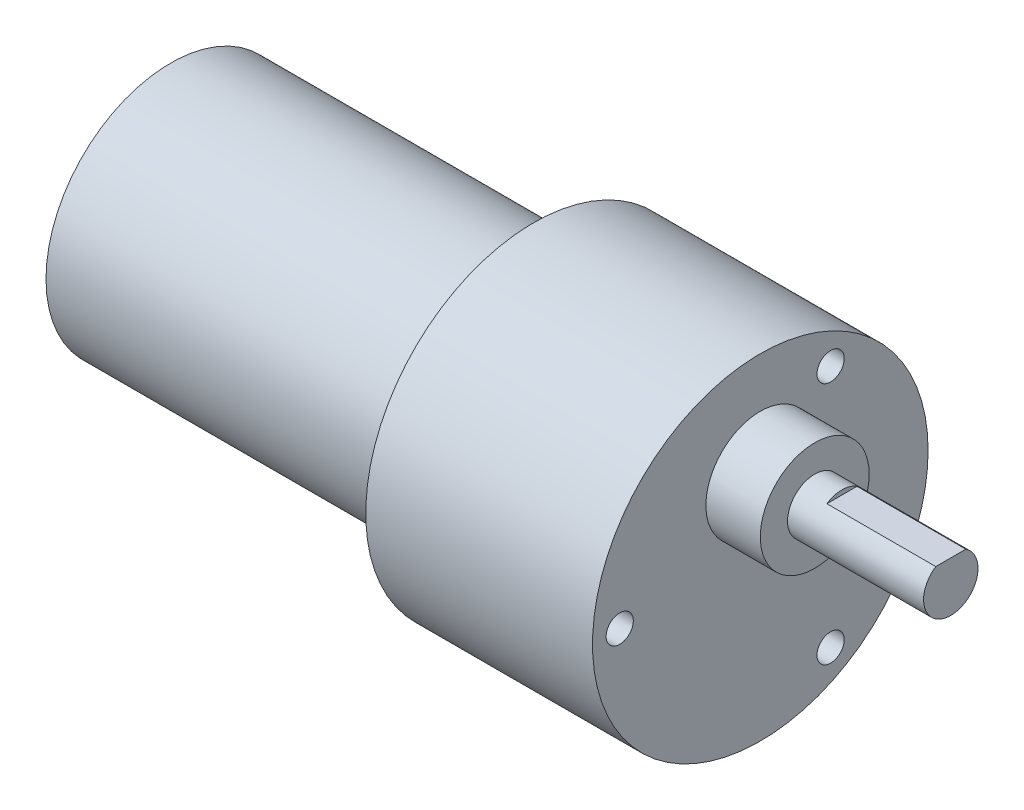
ISO-10303-21;
HEADER;
FILE_DESCRIPTION(('STEP AP214'),'2;1');
FILE_NAME('part.step','',(''),(''),'','','');
FILE_SCHEMA(('AUTOMOTIVE_DESIGN { 1 0 10303 214 1 1 1 1 }'));
ENDSEC;
DATA;
#1=APPLICATION_CONTEXT('core data for automotive mechanical design processes');
#2=APPLICATION_PROTOCOL_DEFINITION('international standard','automotive_design',2000,#1);
#3=PRODUCT_CONTEXT('',#1,'mechanical');
#4=PRODUCT('Part','Part','',(#3));
#5=PRODUCT_RELATED_PRODUCT_CATEGORY('part','',(#4));
#6=PRODUCT_DEFINITION_FORMATION('','',#4);
#7=PRODUCT_DEFINITION_CONTEXT('part definition',#1,'design');
#8=PRODUCT_DEFINITION('design','',#6,#7);
#9=PRODUCT_DEFINITION_SHAPE('','',#8);
#10=(LENGTH_UNIT() NAMED_UNIT(*) SI_UNIT(.MILLI.,.METRE.));
#11=(NAMED_UNIT(*) PLANE_ANGLE_UNIT() SI_UNIT($,.RADIAN.));
#12=(NAMED_UNIT(*) SI_UNIT($,.STERADIAN.) SOLID_ANGLE_UNIT());
#13=UNCERTAINTY_MEASURE_WITH_UNIT(LENGTH_MEASURE(1.E-05),#10,'distance_accuracy_value','');
#14=(GEOMETRIC_REPRESENTATION_CONTEXT(3) GLOBAL_UNCERTAINTY_ASSIGNED_CONTEXT((#13)) GLOBAL_UNIT_ASSIGNED_CONTEXT((#10,
#11,#12)) REPRESENTATION_CONTEXT('',''));
#15=CARTESIAN_POINT('',(0.,0.,0.));
#16=DIRECTION('',(0.,0.,1.));
#17=DIRECTION('',(1.,0.,0.));
#18=AXIS2_PLACEMENT_3D('',#15,#16,#17);
#19=CARTESIAN_POINT('',(20.,0.,0.));
#20=DIRECTION('',(-1.,0.,0.));
#21=DIRECTION('',(0.,0.,1.));
#22=AXIS2_PLACEMENT_3D('',#19,#20,#21);
#23=CYLINDRICAL_SURFACE('',#22,13.75);
#24=CARTESIAN_POINT('',(18.,0.,0.));
#25=DIRECTION('',(1.,0.,0.));
#26=DIRECTION('',(0.,0.,-1.));
#27=AXIS2_PLACEMENT_3D('',#24,#25,#26);
#28=CIRCLE('',#27,13.75);
#29=CARTESIAN_POINT('',(18.,0.,-13.75));
#30=VERTEX_POINT('',#29);
#31=EDGE_CURVE('E11',#30,#30,#28,.F.);
#32=ORIENTED_EDGE('',*,*,#31,.T.);
#33=EDGE_LOOP('',(#32));
#34=FACE_BOUND('',#33,.T.);
#35=CARTESIAN_POINT('',(-20.,0.,0.));
#36=DIRECTION('',(1.,0.,0.));
#37=DIRECTION('',(0.,0.,-1.));
#38=AXIS2_PLACEMENT_3D('',#35,#36,#37);
#39=CIRCLE('',#38,13.75);
#40=CARTESIAN_POINT('',(-20.,0.,-13.75));
#41=VERTEX_POINT('',#40);
#42=EDGE_CURVE('E102',#41,#41,#39,.T.);
#43=ORIENTED_EDGE('',*,*,#42,.T.);
#44=EDGE_LOOP('',(#43));
#45=FACE_BOUND('',#44,.T.);
#46=ADVANCED_FACE('F38',(#34,#45),#23,.T.);
#47=CARTESIAN_POINT('',(-20.,0.,0.));
#48=DIRECTION('',(1.,0.,0.));
#49=DIRECTION('',(0.,0.,-1.));
#50=AXIS2_PLACEMENT_3D('',#47,#48,#49);
#51=PLANE('',#50);
#52=CARTESIAN_POINT('',(-20.,0.,0.));
#53=DIRECTION('',(-1.,0.,0.));
#54=DIRECTION('',(0.,0.,1.));
#55=AXIS2_PLACEMENT_3D('',#52,#53,#54);
#56=CIRCLE('',#55,5.1);
#57=CARTESIAN_POINT('',(-20.,0.,5.1));
#58=VERTEX_POINT('',#57);
#59=EDGE_CURVE('E90',#58,#58,#56,.T.);
#60=ORIENTED_EDGE('',*,*,#59,.F.);
#61=EDGE_LOOP('',(#60));
#62=FACE_BOUND('',#61,.T.);
#63=ORIENTED_EDGE('',*,*,#42,.F.);
#64=EDGE_LOOP('',(#63));
#65=FACE_BOUND('',#64,.T.);
#66=ADVANCED_FACE('F123',(#62,#65),#51,.F.);
#67=CARTESIAN_POINT('',(-23.,0.,0.));
#68=DIRECTION('',(1.,0.,0.));
#69=DIRECTION('',(0.,0.,-1.));
#70=AXIS2_PLACEMENT_3D('',#67,#68,#69);
#71=CYLINDRICAL_SURFACE('',#70,5.1);
#72=CARTESIAN_POINT('',(-23.,0.,0.));
#73=DIRECTION('',(-1.,0.,0.));
#74=DIRECTION('',(0.,0.,1.));
#75=AXIS2_PLACEMENT_3D('',#72,#73,#74);
#76=CIRCLE('',#75,5.1);
#77=CARTESIAN_POINT('',(-23.,0.,5.1));
#78=VERTEX_POINT('',#77);
#79=EDGE_CURVE('E97',#78,#78,#76,.T.);
#80=ORIENTED_EDGE('',*,*,#79,.F.);
#81=EDGE_LOOP('',(#80));
#82=FACE_BOUND('',#81,.T.);
#83=ORIENTED_EDGE('',*,*,#59,.T.);
#84=EDGE_LOOP('',(#83));
#85=FACE_BOUND('',#84,.T.);
#86=ADVANCED_FACE('F128',(#82,#85),#71,.T.);
#87=CARTESIAN_POINT('',(-23.,0.,0.));
#88=DIRECTION('',(-1.,0.,0.));
#89=DIRECTION('',(0.,0.,1.));
#90=AXIS2_PLACEMENT_3D('',#87,#88,#89);
#91=PLANE('',#90);
#92=ORIENTED_EDGE('',*,*,#79,.T.);
#93=EDGE_LOOP('',(#92));
#94=FACE_BOUND('',#93,.T.);
#95=ADVANCED_FACE('F135',(#94),#91,.T.);
#96=CARTESIAN_POINT('',(45.,0.,0.));
#97=DIRECTION('',(-1.,0.,0.));
#98=DIRECTION('',(0.,0.,1.));
#99=AXIS2_PLACEMENT_3D('',#96,#97,#98);
#100=CYLINDRICAL_SURFACE('',#99,18.5);
#101=CARTESIAN_POINT('',(45.,0.,0.));
#102=DIRECTION('',(1.,0.,0.));
#103=DIRECTION('',(0.,0.,-1.));
#104=AXIS2_PLACEMENT_3D('',#101,#102,#103);
#105=CIRCLE('',#104,18.5);
#106=CARTESIAN_POINT('',(45.,0.,-18.5));
#107=VERTEX_POINT('',#106);
#108=EDGE_CURVE('E94',#107,#107,#105,.T.);
#109=ORIENTED_EDGE('',*,*,#108,.F.);
#110=EDGE_LOOP('',(#109));
#111=FACE_BOUND('',#110,.T.);
#112=CARTESIAN_POINT('',(20.,0.,0.));
#113=DIRECTION('',(1.,0.,0.));
#114=DIRECTION('',(0.,0.,-1.));
#115=AXIS2_PLACEMENT_3D('',#112,#113,#114);
#116=CIRCLE('',#115,18.5);
#117=CARTESIAN_POINT('',(20.,0.,-18.5));
#118=VERTEX_POINT('',#117);
#119=EDGE_CURVE('E92',#118,#118,#116,.T.);
#120=ORIENTED_EDGE('',*,*,#119,.T.);
#121=EDGE_LOOP('',(#120));
#122=FACE_BOUND('',#121,.T.);
#123=ADVANCED_FACE('F139',(#111,#122),#100,.T.);
#124=CARTESIAN_POINT('',(45.,0.,0.));
#125=DIRECTION('',(1.,0.,0.));
#126=DIRECTION('',(0.,0.,-1.));
#127=AXIS2_PLACEMENT_3D('',#124,#125,#126);
#128=PLANE('',#127);
#129=CARTESIAN_POINT('',(45.,0.,15.5));
#130=DIRECTION('',(1.,0.,0.));
#131=DIRECTION('',(0.,0.,-1.));
#132=AXIS2_PLACEMENT_3D('',#129,#130,#131);
#133=CIRCLE('',#132,1.5);
#134=CARTESIAN_POINT('',(45.,0.,14.));
#135=VERTEX_POINT('',#134);
#136=EDGE_CURVE('E193',#135,#135,#133,.T.);
#137=ORIENTED_EDGE('',*,*,#136,.F.);
#138=EDGE_LOOP('',(#137));
#139=FACE_BOUND('',#138,.T.);
#140=CARTESIAN_POINT('',(45.,13.4233937586588,-7.75000000000006));
#141=DIRECTION('',(1.,0.,0.));
#142=DIRECTION('',(0.,0.,-1.));
#143=AXIS2_PLACEMENT_3D('',#140,#141,#142);
#144=CIRCLE('',#143,1.5);
#145=CARTESIAN_POINT('',(45.,13.4233937586588,-9.25000000000006));
#146=VERTEX_POINT('',#145);
#147=EDGE_CURVE('E198',#146,#146,#144,.T.);
#148=ORIENTED_EDGE('',*,*,#147,.F.);
#149=EDGE_LOOP('',(#148));
#150=FACE_BOUND('',#149,.T.);
#151=CARTESIAN_POINT('',(45.,-13.4233937586589,-7.74999999999987));
#152=DIRECTION('',(1.,0.,0.));
#153=DIRECTION('',(0.,0.,-1.));
#154=AXIS2_PLACEMENT_3D('',#151,#152,#153);
#155=CIRCLE('',#154,1.5);
#156=CARTESIAN_POINT('',(45.,-13.4233937586589,-9.24999999999988));
#157=VERTEX_POINT('',#156);
#158=EDGE_CURVE('E206',#157,#157,#155,.T.);
#159=ORIENTED_EDGE('',*,*,#158,.F.);
#160=EDGE_LOOP('',(#159));
#161=FACE_BOUND('',#160,.T.);
#162=CARTESIAN_POINT('',(45.,7.,0.));
#163=DIRECTION('',(1.,0.,0.));
#164=DIRECTION('',(0.,0.,-1.));
#165=AXIS2_PLACEMENT_3D('',#162,#163,#164);
#166=CIRCLE('',#165,6.);
#167=CARTESIAN_POINT('',(45.,7.,-6.));
#168=VERTEX_POINT('',#167);
#169=EDGE_CURVE('E80',#168,#168,#166,.T.);
#170=ORIENTED_EDGE('',*,*,#169,.F.);
#171=EDGE_LOOP('',(#170));
#172=FACE_BOUND('',#171,.T.);
#173=ORIENTED_EDGE('',*,*,#108,.T.);
#174=EDGE_LOOP('',(#173));
#175=FACE_BOUND('',#174,.T.);
#176=ADVANCED_FACE('F143',(#139,#150,#161,#172,#175),#128,.T.);
#177=CARTESIAN_POINT('',(20.,0.,0.));
#178=DIRECTION('',(1.,0.,0.));
#179=DIRECTION('',(0.,0.,-1.));
#180=AXIS2_PLACEMENT_3D('',#177,#178,#179);
#181=PLANE('',#180);
#182=CARTESIAN_POINT('',(20.,0.,0.));
#183=DIRECTION('',(1.,0.,0.));
#184=DIRECTION('',(0.,0.,-1.));
#185=AXIS2_PLACEMENT_3D('',#182,#183,#184);
#186=CIRCLE('',#185,15.75);
#187=CARTESIAN_POINT('',(20.,0.,-15.75));
#188=VERTEX_POINT('',#187);
#189=EDGE_CURVE('E47',#188,#188,#186,.T.);
#190=ORIENTED_EDGE('',*,*,#189,.T.);
#191=EDGE_LOOP('',(#190));
#192=FACE_BOUND('',#191,.T.);
#193=ORIENTED_EDGE('',*,*,#119,.F.);
#194=EDGE_LOOP('',(#193));
#195=FACE_BOUND('',#194,.T.);
#196=ADVANCED_FACE('F109',(#192,#195),#181,.F.);
#197=CARTESIAN_POINT('',(51.,7.,0.));
#198=DIRECTION('',(-1.,0.,0.));
#199=DIRECTION('',(0.,0.,1.));
#200=AXIS2_PLACEMENT_3D('',#197,#198,#199);
#201=CYLINDRICAL_SURFACE('',#200,6.);
#202=CARTESIAN_POINT('',(51.,7.,0.));
#203=DIRECTION('',(1.,0.,0.));
#204=DIRECTION('',(0.,0.,-1.));
#205=AXIS2_PLACEMENT_3D('',#202,#203,#204);
#206=CIRCLE('',#205,6.);
#207=CARTESIAN_POINT('',(51.,7.,-6.));
#208=VERTEX_POINT('',#207);
#209=EDGE_CURVE('E83',#208,#208,#206,.T.);
#210=ORIENTED_EDGE('',*,*,#209,.F.);
#211=EDGE_LOOP('',(#210));
#212=FACE_BOUND('',#211,.T.);
#213=ORIENTED_EDGE('',*,*,#169,.T.);
#214=EDGE_LOOP('',(#213));
#215=FACE_BOUND('',#214,.T.);
#216=ADVANCED_FACE('F147',(#212,#215),#201,.T.);
#217=CARTESIAN_POINT('',(51.,7.,0.));
#218=DIRECTION('',(1.,0.,0.));
#219=DIRECTION('',(0.,0.,-1.));
#220=AXIS2_PLACEMENT_3D('',#217,#218,#219);
#221=PLANE('',#220);
#222=CARTESIAN_POINT('',(51.,7.,0.));
#223=DIRECTION('',(1.,0.,0.));
#224=DIRECTION('',(0.,0.,-1.));
#225=AXIS2_PLACEMENT_3D('',#222,#223,#224);
#226=CIRCLE('',#225,3.);
#227=CARTESIAN_POINT('',(51.,7.,-3.));
#228=VERTEX_POINT('',#227);
#229=EDGE_CURVE('E87',#228,#228,#226,.T.);
#230=ORIENTED_EDGE('',*,*,#229,.F.);
#231=EDGE_LOOP('',(#230));
#232=FACE_BOUND('',#231,.T.);
#233=ORIENTED_EDGE('',*,*,#209,.T.);
#234=EDGE_LOOP('',(#233));
#235=FACE_BOUND('',#234,.T.);
#236=ADVANCED_FACE('F153',(#232,#235),#221,.T.);
#237=CARTESIAN_POINT('',(66.,7.,0.));
#238=DIRECTION('',(-1.,0.,0.));
#239=DIRECTION('',(0.,0.,1.));
#240=AXIS2_PLACEMENT_3D('',#237,#238,#239);
#241=CYLINDRICAL_SURFACE('',#240,3.);
#242=CARTESIAN_POINT('',(66.,7.,0.));
#243=DIRECTION('',(1.,0.,0.));
#244=DIRECTION('',(0.,0.,-1.));
#245=AXIS2_PLACEMENT_3D('',#242,#243,#244);
#246=CIRCLE('',#245,3.);
#247=CARTESIAN_POINT('',(66.,9.5,1.6583123951777));
#248=VERTEX_POINT('',#247);
#249=CARTESIAN_POINT('',(66.,9.5,-1.6583123951777));
#250=VERTEX_POINT('',#249);
#251=EDGE_CURVE('E77',#248,#250,#246,.T.);
#252=ORIENTED_EDGE('',*,*,#251,.F.);
#253=DIRECTION('',(1.,0.,0.));
#254=VECTOR('',#253,1.);
#255=CARTESIAN_POINT('',(54.,9.5,1.6583123951777));
#256=LINE('',#255,#254);
#257=CARTESIAN_POINT('',(54.,9.5,1.6583123951777));
#258=VERTEX_POINT('',#257);
#259=EDGE_CURVE('E54',#258,#248,#256,.T.);
#260=ORIENTED_EDGE('',*,*,#259,.F.);
#261=CARTESIAN_POINT('',(54.,7.,0.));
#262=DIRECTION('',(1.,0.,0.));
#263=DIRECTION('',(0.,0.,-1.));
#264=AXIS2_PLACEMENT_3D('',#261,#262,#263);
#265=CIRCLE('',#264,3.);
#266=CARTESIAN_POINT('',(54.,9.5,-1.6583123951777));
#267=VERTEX_POINT('',#266);
#268=EDGE_CURVE('E70',#267,#258,#265,.T.);
#269=ORIENTED_EDGE('',*,*,#268,.F.);
#270=DIRECTION('',(1.,0.,0.));
#271=VECTOR('',#270,1.);
#272=CARTESIAN_POINT('',(54.,9.5,-1.6583123951777));
#273=LINE('',#272,#271);
#274=EDGE_CURVE('E60',#267,#250,#273,.T.);
#275=ORIENTED_EDGE('',*,*,#274,.T.);
#276=EDGE_LOOP('',(#252,#260,#269,#275));
#277=FACE_BOUND('',#276,.T.);
#278=ORIENTED_EDGE('',*,*,#229,.T.);
#279=EDGE_LOOP('',(#278));
#280=FACE_BOUND('',#279,.T.);
#281=ADVANCED_FACE('F75',(#277,#280),#241,.T.);
#282=CARTESIAN_POINT('',(66.,7.,0.));
#283=DIRECTION('',(1.,0.,0.));
#284=DIRECTION('',(0.,0.,-1.));
#285=AXIS2_PLACEMENT_3D('',#282,#283,#284);
#286=PLANE('',#285);
#287=DIRECTION('',(0.,0.,-1.));
#288=VECTOR('',#287,1.);
#289=CARTESIAN_POINT('',(66.,9.5,0.));
#290=LINE('',#289,#288);
#291=EDGE_CURVE('E65',#248,#250,#290,.T.);
#292=ORIENTED_EDGE('',*,*,#291,.F.);
#293=ORIENTED_EDGE('',*,*,#251,.T.);
#294=EDGE_LOOP('',(#292,#293));
#295=FACE_BOUND('',#294,.T.);
#296=ADVANCED_FACE('F79',(#295),#286,.T.);
#297=CARTESIAN_POINT('',(54.,9.5,0.));
#298=DIRECTION('',(0.,-1.,0.));
#299=DIRECTION('',(0.,0.,-1.));
#300=AXIS2_PLACEMENT_3D('',#297,#298,#299);
#301=PLANE('',#300);
#302=ORIENTED_EDGE('',*,*,#291,.T.);
#303=ORIENTED_EDGE('',*,*,#274,.F.);
#304=DIRECTION('',(0.,0.,-1.));
#305=VECTOR('',#304,1.);
#306=CARTESIAN_POINT('',(54.,9.5,0.));
#307=LINE('',#306,#305);
#308=EDGE_CURVE('E210',#258,#267,#307,.T.);
#309=ORIENTED_EDGE('',*,*,#308,.F.);
#310=ORIENTED_EDGE('',*,*,#259,.T.);
#311=EDGE_LOOP('',(#302,#303,#309,#310));
#312=FACE_BOUND('',#311,.T.);
#313=ADVANCED_FACE('F66',(#312),#301,.F.);
#314=CARTESIAN_POINT('',(54.,0.,0.));
#315=DIRECTION('',(1.,0.,0.));
#316=DIRECTION('',(0.,0.,-1.));
#317=AXIS2_PLACEMENT_3D('',#314,#315,#316);
#318=PLANE('',#317);
#319=ORIENTED_EDGE('',*,*,#268,.T.);
#320=ORIENTED_EDGE('',*,*,#308,.T.);
#321=EDGE_LOOP('',(#319,#320));
#322=FACE_BOUND('',#321,.T.);
#323=ADVANCED_FACE('F164',(#322),#318,.T.);
#324=CARTESIAN_POINT('',(42.,-13.4233937586589,-7.74999999999987));
#325=DIRECTION('',(1.,0.,0.));
#326=DIRECTION('',(0.,0.,-1.));
#327=AXIS2_PLACEMENT_3D('',#324,#325,#326);
#328=CYLINDRICAL_SURFACE('',#327,1.5);
#329=CARTESIAN_POINT('',(42.,-13.4233937586589,-7.74999999999987));
#330=DIRECTION('',(1.,0.,0.));
#331=DIRECTION('',(0.,0.,-1.));
#332=AXIS2_PLACEMENT_3D('',#329,#330,#331);
#333=CIRCLE('',#332,1.5);
#334=CARTESIAN_POINT('',(42.,-13.4233937586589,-9.24999999999988));
#335=VERTEX_POINT('',#334);
#336=EDGE_CURVE('E203',#335,#335,#333,.T.);
#337=ORIENTED_EDGE('',*,*,#336,.F.);
#338=EDGE_LOOP('',(#337));
#339=FACE_BOUND('',#338,.T.);
#340=ORIENTED_EDGE('',*,*,#158,.T.);
#341=EDGE_LOOP('',(#340));
#342=FACE_BOUND('',#341,.T.);
#343=ADVANCED_FACE('F167',(#339,#342),#328,.F.);
#344=CARTESIAN_POINT('',(42.,-13.4233937586589,-7.74999999999987));
#345=DIRECTION('',(1.,0.,0.));
#346=DIRECTION('',(0.,0.,-1.));
#347=AXIS2_PLACEMENT_3D('',#344,#345,#346);
#348=PLANE('',#347);
#349=ORIENTED_EDGE('',*,*,#336,.T.);
#350=EDGE_LOOP('',(#349));
#351=FACE_BOUND('',#350,.T.);
#352=ADVANCED_FACE('F171',(#351),#348,.T.);
#353=CARTESIAN_POINT('',(42.,13.4233937586588,-7.75000000000006));
#354=DIRECTION('',(1.,0.,0.));
#355=DIRECTION('',(0.,0.,-1.));
#356=AXIS2_PLACEMENT_3D('',#353,#354,#355);
#357=CYLINDRICAL_SURFACE('',#356,1.5);
#358=CARTESIAN_POINT('',(42.,13.4233937586588,-7.75000000000006));
#359=DIRECTION('',(1.,0.,0.));
#360=DIRECTION('',(0.,0.,-1.));
#361=AXIS2_PLACEMENT_3D('',#358,#359,#360);
#362=CIRCLE('',#361,1.5);
#363=CARTESIAN_POINT('',(42.,13.4233937586588,-9.25000000000006));
#364=VERTEX_POINT('',#363);
#365=EDGE_CURVE('E194',#364,#364,#362,.T.);
#366=ORIENTED_EDGE('',*,*,#365,.F.);
#367=EDGE_LOOP('',(#366));
#368=FACE_BOUND('',#367,.T.);
#369=ORIENTED_EDGE('',*,*,#147,.T.);
#370=EDGE_LOOP('',(#369));
#371=FACE_BOUND('',#370,.T.);
#372=ADVANCED_FACE('F175',(#368,#371),#357,.F.);
#373=CARTESIAN_POINT('',(42.,13.4233937586588,-7.75000000000006));
#374=DIRECTION('',(1.,0.,0.));
#375=DIRECTION('',(0.,0.,-1.));
#376=AXIS2_PLACEMENT_3D('',#373,#374,#375);
#377=PLANE('',#376);
#378=ORIENTED_EDGE('',*,*,#365,.T.);
#379=EDGE_LOOP('',(#378));
#380=FACE_BOUND('',#379,.T.);
#381=ADVANCED_FACE('F179',(#380),#377,.T.);
#382=CARTESIAN_POINT('',(42.,0.,15.5));
#383=DIRECTION('',(1.,0.,0.));
#384=DIRECTION('',(0.,0.,-1.));
#385=AXIS2_PLACEMENT_3D('',#382,#383,#384);
#386=CYLINDRICAL_SURFACE('',#385,1.5);
#387=CARTESIAN_POINT('',(42.,0.,15.5));
#388=DIRECTION('',(1.,0.,0.));
#389=DIRECTION('',(0.,0.,-1.));
#390=AXIS2_PLACEMENT_3D('',#387,#388,#389);
#391=CIRCLE('',#390,1.5);
#392=CARTESIAN_POINT('',(42.,0.,14.));
#393=VERTEX_POINT('',#392);
#394=EDGE_CURVE('E71',#393,#393,#391,.T.);
#395=ORIENTED_EDGE('',*,*,#394,.F.);
#396=EDGE_LOOP('',(#395));
#397=FACE_BOUND('',#396,.T.);
#398=ORIENTED_EDGE('',*,*,#136,.T.);
#399=EDGE_LOOP('',(#398));
#400=FACE_BOUND('',#399,.T.);
#401=ADVANCED_FACE('F118',(#397,#400),#386,.F.);
#402=CARTESIAN_POINT('',(42.,0.,15.5));
#403=DIRECTION('',(1.,0.,0.));
#404=DIRECTION('',(0.,0.,-1.));
#405=AXIS2_PLACEMENT_3D('',#402,#403,#404);
#406=PLANE('',#405);
#407=ORIENTED_EDGE('',*,*,#394,.T.);
#408=EDGE_LOOP('',(#407));
#409=FACE_BOUND('',#408,.T.);
#410=ADVANCED_FACE('F113',(#409),#406,.T.);
#411=CARTESIAN_POINT('',(20.,0.,0.));
#412=DIRECTION('',(1.,0.,0.));
#413=DIRECTION('',(0.,0.,-1.));
#414=AXIS2_PLACEMENT_3D('',#411,#412,#413);
#415=CONICAL_SURFACE('',#414,15.75,0.785398163397452);
#416=ORIENTED_EDGE('',*,*,#31,.F.);
#417=EDGE_LOOP('',(#416));
#418=FACE_BOUND('',#417,.T.);
#419=ORIENTED_EDGE('',*,*,#189,.F.);
#420=EDGE_LOOP('',(#419));
#421=FACE_BOUND('',#420,.T.);
#422=ADVANCED_FACE('F41',(#418,#421),#415,.T.);
#423=CLOSED_SHELL('',(#46,#66,#86,#95,#123,#176,#196,#216,#236,#281,#296,#313,#323,#343,#352,
#372,#381,#401,#410,#422));
#424=MANIFOLD_SOLID_BREP('B2',#423);
#425=ADVANCED_BREP_SHAPE_REPRESENTATION('',(#18,#424),#14);
#426=SHAPE_DEFINITION_REPRESENTATION(#9,#425);
ENDSEC;
END-ISO-10303-21;
